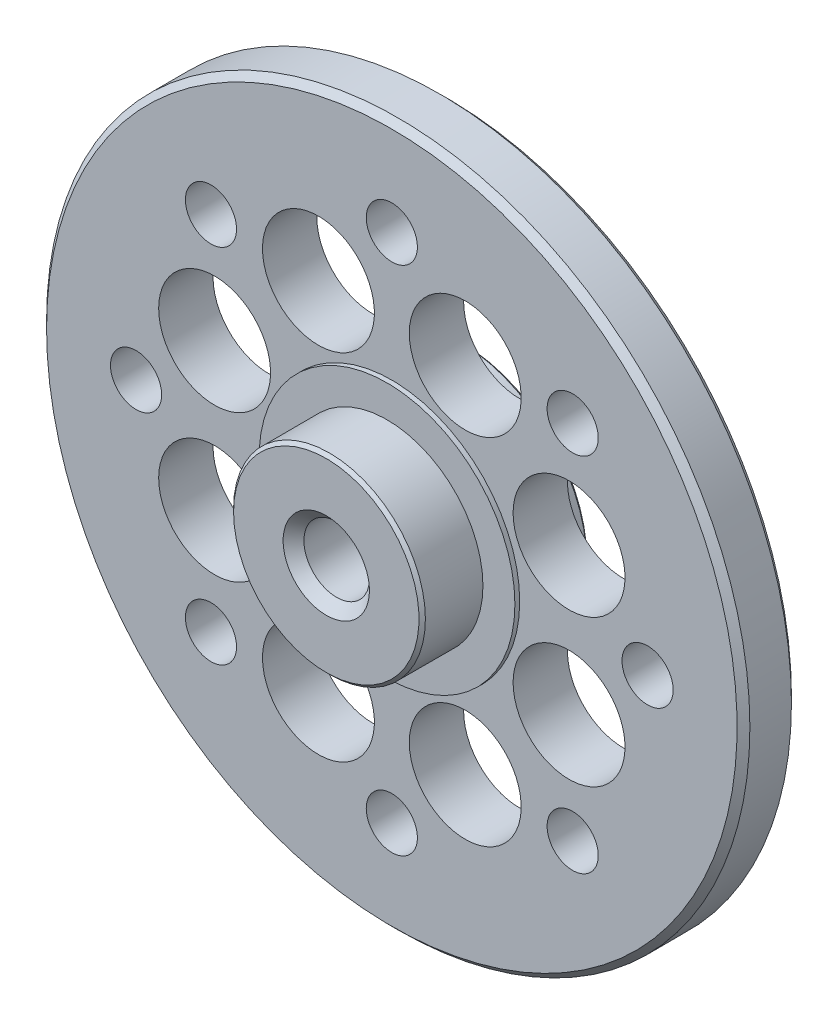
ISO-10303-21;
HEADER;
FILE_DESCRIPTION(('STEP AP214'),'2;1');
FILE_NAME('part.step','',(''),(''),'','','');
FILE_SCHEMA(('AUTOMOTIVE_DESIGN { 1 0 10303 214 1 1 1 1 }'));
ENDSEC;
DATA;
#1=APPLICATION_CONTEXT('core data for automotive mechanical design processes');
#2=APPLICATION_PROTOCOL_DEFINITION('international standard','automotive_design',2000,#1);
#3=PRODUCT_CONTEXT('',#1,'mechanical');
#4=PRODUCT('Part','Part','',(#3));
#5=PRODUCT_RELATED_PRODUCT_CATEGORY('part','',(#4));
#6=PRODUCT_DEFINITION_FORMATION('','',#4);
#7=PRODUCT_DEFINITION_CONTEXT('part definition',#1,'design');
#8=PRODUCT_DEFINITION('design','',#6,#7);
#9=PRODUCT_DEFINITION_SHAPE('','',#8);
#10=(LENGTH_UNIT() NAMED_UNIT(*) SI_UNIT(.MILLI.,.METRE.));
#11=(NAMED_UNIT(*) PLANE_ANGLE_UNIT() SI_UNIT($,.RADIAN.));
#12=(NAMED_UNIT(*) SI_UNIT($,.STERADIAN.) SOLID_ANGLE_UNIT());
#13=UNCERTAINTY_MEASURE_WITH_UNIT(LENGTH_MEASURE(1.E-05),#10,'distance_accuracy_value','');
#14=(GEOMETRIC_REPRESENTATION_CONTEXT(3) GLOBAL_UNCERTAINTY_ASSIGNED_CONTEXT((#13)) GLOBAL_UNIT_ASSIGNED_CONTEXT((#10,
#11,#12)) REPRESENTATION_CONTEXT('',''));
#15=CARTESIAN_POINT('',(0.,0.,0.));
#16=DIRECTION('',(0.,0.,1.));
#17=DIRECTION('',(1.,0.,0.));
#18=AXIS2_PLACEMENT_3D('',#15,#16,#17);
#19=CARTESIAN_POINT('',(0.,0.,3.74999999991132));
#20=DIRECTION('',(0.,0.,1.));
#21=DIRECTION('',(1.,0.,0.));
#22=AXIS2_PLACEMENT_3D('',#19,#20,#21);
#23=CONICAL_SURFACE('',#22,1.35000000000218,0.785398163397448);
#24=CARTESIAN_POINT('',(0.,0.,3.425));
#25=DIRECTION('',(0.,0.,1.));
#26=DIRECTION('',(1.,0.,0.));
#27=AXIS2_PLACEMENT_3D('',#24,#25,#26);
#28=CIRCLE('',#27,1.025);
#29=CARTESIAN_POINT('',(1.025,0.,3.425));
#30=VERTEX_POINT('',#29);
#31=EDGE_CURVE('E30',#30,#30,#28,.F.);
#32=ORIENTED_EDGE('',*,*,#31,.T.);
#33=EDGE_LOOP('',(#32));
#34=FACE_BOUND('',#33,.T.);
#35=CARTESIAN_POINT('',(0.,0.,3.75000000002501));
#36=DIRECTION('',(0.,0.,1.));
#37=DIRECTION('',(1.,0.,0.));
#38=AXIS2_PLACEMENT_3D('',#35,#36,#37);
#39=CIRCLE('',#38,1.35000000011587);
#40=CARTESIAN_POINT('',(1.35000000011587,0.,3.75000000002501));
#41=VERTEX_POINT('',#40);
#42=EDGE_CURVE('E18',#41,#41,#39,.F.);
#43=ORIENTED_EDGE('',*,*,#42,.F.);
#44=EDGE_LOOP('',(#43));
#45=FACE_BOUND('',#44,.T.);
#46=ADVANCED_FACE('F15',(#34,#45),#23,.F.);
#47=CARTESIAN_POINT('',(0.,0.,-1.167));
#48=DIRECTION('',(0.,0.,1.));
#49=DIRECTION('',(1.,0.,0.));
#50=AXIS2_PLACEMENT_3D('',#47,#48,#49);
#51=CYLINDRICAL_SURFACE('',#50,1.025);
#52=ORIENTED_EDGE('',*,*,#31,.F.);
#53=EDGE_LOOP('',(#52));
#54=FACE_BOUND('',#53,.T.);
#55=CARTESIAN_POINT('',(0.,0.,-0.5));
#56=DIRECTION('',(0.,0.,1.));
#57=DIRECTION('',(1.,0.,0.));
#58=AXIS2_PLACEMENT_3D('',#55,#56,#57);
#59=CIRCLE('',#58,1.025);
#60=CARTESIAN_POINT('',(1.025,0.,-0.5));
#61=VERTEX_POINT('',#60);
#62=EDGE_CURVE('E150',#61,#61,#59,.F.);
#63=ORIENTED_EDGE('',*,*,#62,.T.);
#64=EDGE_LOOP('',(#63));
#65=FACE_BOUND('',#64,.T.);
#66=ADVANCED_FACE('F162',(#54,#65),#51,.F.);
#67=CARTESIAN_POINT('',(0.,0.,3.75));
#68=DIRECTION('',(0.,0.,1.));
#69=DIRECTION('',(1.,0.,0.));
#70=AXIS2_PLACEMENT_3D('',#67,#68,#69);
#71=PLANE('',#70);
#72=ORIENTED_EDGE('',*,*,#42,.T.);
#73=EDGE_LOOP('',(#72));
#74=FACE_BOUND('',#73,.T.);
#75=CARTESIAN_POINT('',(0.,0.,3.75000000002501));
#76=DIRECTION('',(0.,0.,-1.));
#77=DIRECTION('',(-1.,0.,0.));
#78=AXIS2_PLACEMENT_3D('',#75,#76,#77);
#79=CIRCLE('',#78,2.900000000011);
#80=CARTESIAN_POINT('',(-2.900000000011,0.,3.75000000002501));
#81=VERTEX_POINT('',#80);
#82=EDGE_CURVE('E148',#81,#81,#79,.T.);
#83=ORIENTED_EDGE('',*,*,#82,.F.);
#84=EDGE_LOOP('',(#83));
#85=FACE_BOUND('',#84,.T.);
#86=ADVANCED_FACE('F164',(#74,#85),#71,.T.);
#87=CARTESIAN_POINT('',(0.,0.,-0.5));
#88=DIRECTION('',(0.,0.,1.));
#89=DIRECTION('',(1.,0.,0.));
#90=AXIS2_PLACEMENT_3D('',#87,#88,#89);
#91=PLANE('',#90);
#92=ORIENTED_EDGE('',*,*,#62,.F.);
#93=EDGE_LOOP('',(#92));
#94=FACE_BOUND('',#93,.T.);
#95=CARTESIAN_POINT('',(0.,0.,-0.499999999988177));
#96=DIRECTION('',(0.,0.,1.));
#97=DIRECTION('',(1.,0.,0.));
#98=AXIS2_PLACEMENT_3D('',#95,#96,#97);
#99=CIRCLE('',#98,3.89999999998736);
#100=CARTESIAN_POINT('',(3.89999999998736,0.,-0.499999999988177));
#101=VERTEX_POINT('',#100);
#102=EDGE_CURVE('E144',#101,#101,#99,.T.);
#103=ORIENTED_EDGE('',*,*,#102,.F.);
#104=EDGE_LOOP('',(#103));
#105=FACE_BOUND('',#104,.T.);
#106=ADVANCED_FACE('F170',(#94,#105),#91,.F.);
#107=CARTESIAN_POINT('',(0.,0.,3.65000000010696));
#108=DIRECTION('',(0.,0.,-1.));
#109=DIRECTION('',(-1.,0.,0.));
#110=AXIS2_PLACEMENT_3D('',#107,#108,#109);
#111=CONICAL_SURFACE('',#110,2.99999999992906,0.785398163397448);
#112=ORIENTED_EDGE('',*,*,#82,.T.);
#113=EDGE_LOOP('',(#112));
#114=FACE_BOUND('',#113,.T.);
#115=CARTESIAN_POINT('',(0.,0.,3.65));
#116=DIRECTION('',(0.,0.,1.));
#117=DIRECTION('',(1.,0.,0.));
#118=AXIS2_PLACEMENT_3D('',#115,#116,#117);
#119=CIRCLE('',#118,3.);
#120=CARTESIAN_POINT('',(3.,0.,3.65));
#121=VERTEX_POINT('',#120);
#122=EDGE_CURVE('E147',#121,#121,#119,.F.);
#123=ORIENTED_EDGE('',*,*,#122,.F.);
#124=EDGE_LOOP('',(#123));
#125=FACE_BOUND('',#124,.T.);
#126=ADVANCED_FACE('F310',(#114,#125),#111,.T.);
#127=CARTESIAN_POINT('',(0.,0.,-0.399999999956435));
#128=DIRECTION('',(0.,0.,1.));
#129=DIRECTION('',(1.,0.,0.));
#130=AXIS2_PLACEMENT_3D('',#127,#128,#129);
#131=CONICAL_SURFACE('',#130,3.99999999996226,0.785398163113231);
#132=CARTESIAN_POINT('',(0.,0.,-0.4));
#133=DIRECTION('',(0.,0.,1.));
#134=DIRECTION('',(1.,0.,0.));
#135=AXIS2_PLACEMENT_3D('',#132,#133,#134);
#136=CIRCLE('',#135,4.);
#137=CARTESIAN_POINT('',(4.,0.,-0.4));
#138=VERTEX_POINT('',#137);
#139=EDGE_CURVE('E562',#138,#138,#136,.T.);
#140=ORIENTED_EDGE('',*,*,#139,.F.);
#141=EDGE_LOOP('',(#140));
#142=FACE_BOUND('',#141,.T.);
#143=ORIENTED_EDGE('',*,*,#102,.T.);
#144=EDGE_LOOP('',(#143));
#145=FACE_BOUND('',#144,.T.);
#146=ADVANCED_FACE('F306',(#142,#145),#131,.T.);
#147=CARTESIAN_POINT('',(0.,0.,-0.7125));
#148=DIRECTION('',(0.,0.,1.));
#149=DIRECTION('',(1.,0.,0.));
#150=AXIS2_PLACEMENT_3D('',#147,#148,#149);
#151=CYLINDRICAL_SURFACE('',#150,3.);
#152=CARTESIAN_POINT('',(0.,0.,1.85));
#153=DIRECTION('',(0.,0.,1.));
#154=DIRECTION('',(1.,0.,0.));
#155=AXIS2_PLACEMENT_3D('',#152,#153,#154);
#156=CIRCLE('',#155,3.);
#157=CARTESIAN_POINT('',(3.,0.,1.85));
#158=VERTEX_POINT('',#157);
#159=EDGE_CURVE('E140',#158,#158,#156,.F.);
#160=ORIENTED_EDGE('',*,*,#159,.F.);
#161=EDGE_LOOP('',(#160));
#162=FACE_BOUND('',#161,.T.);
#163=ORIENTED_EDGE('',*,*,#122,.T.);
#164=EDGE_LOOP('',(#163));
#165=FACE_BOUND('',#164,.T.);
#166=ADVANCED_FACE('F302',(#162,#165),#151,.T.);
#167=CARTESIAN_POINT('',(0.,0.,0.200001241523865));
#168=DIRECTION('',(0.,0.,1.));
#169=DIRECTION('',(1.,0.,0.));
#170=AXIS2_PLACEMENT_3D('',#167,#168,#169);
#171=CONICAL_SURFACE('',#170,10.9999997023146,0.785398093433157);
#172=CARTESIAN_POINT('',(0.,0.,0.2000009438385));
#173=DIRECTION('',(0.,0.,1.));
#174=DIRECTION('',(1.,0.,0.));
#175=AXIS2_PLACEMENT_3D('',#172,#173,#174);
#176=CIRCLE('',#175,11.);
#177=CARTESIAN_POINT('',(11.,0.,0.2000009438385));
#178=VERTEX_POINT('',#177);
#179=EDGE_CURVE('E143',#178,#178,#176,.T.);
#180=ORIENTED_EDGE('',*,*,#179,.F.);
#181=EDGE_LOOP('',(#180));
#182=FACE_BOUND('',#181,.T.);
#183=CARTESIAN_POINT('',(0.,0.,2.93602862508346E-07));
#184=DIRECTION('',(0.,0.,1.));
#185=DIRECTION('',(1.,0.,0.));
#186=AXIS2_PLACEMENT_3D('',#183,#184,#185);
#187=CIRCLE('',#186,10.7999987823794);
#188=CARTESIAN_POINT('',(10.7999987823794,0.,2.93602862508346E-07));
#189=VERTEX_POINT('',#188);
#190=EDGE_CURVE('E137',#189,#189,#187,.T.);
#191=ORIENTED_EDGE('',*,*,#190,.T.);
#192=EDGE_LOOP('',(#191));
#193=FACE_BOUND('',#192,.T.);
#194=ADVANCED_FACE('F298',(#182,#193),#171,.T.);
#195=CARTESIAN_POINT('',(0.,0.,-0.7125));
#196=DIRECTION('',(0.,0.,1.));
#197=DIRECTION('',(1.,0.,0.));
#198=AXIS2_PLACEMENT_3D('',#195,#196,#197);
#199=CYLINDRICAL_SURFACE('',#198,4.);
#200=ORIENTED_EDGE('',*,*,#139,.T.);
#201=EDGE_LOOP('',(#200));
#202=FACE_BOUND('',#201,.T.);
#203=CARTESIAN_POINT('',(0.,0.,0.));
#204=DIRECTION('',(0.,0.,1.));
#205=DIRECTION('',(1.,0.,0.));
#206=AXIS2_PLACEMENT_3D('',#203,#204,#205);
#207=CIRCLE('',#206,4.);
#208=CARTESIAN_POINT('',(4.,0.,0.));
#209=VERTEX_POINT('',#208);
#210=EDGE_CURVE('E134',#209,#209,#207,.F.);
#211=ORIENTED_EDGE('',*,*,#210,.T.);
#212=EDGE_LOOP('',(#211));
#213=FACE_BOUND('',#212,.T.);
#214=ADVANCED_FACE('F294',(#202,#213),#199,.T.);
#215=CARTESIAN_POINT('',(0.,0.,-0.7125));
#216=DIRECTION('',(0.,0.,1.));
#217=DIRECTION('',(1.,0.,0.));
#218=AXIS2_PLACEMENT_3D('',#215,#216,#217);
#219=CYLINDRICAL_SURFACE('',#218,11.);
#220=ORIENTED_EDGE('',*,*,#179,.T.);
#221=EDGE_LOOP('',(#220));
#222=FACE_BOUND('',#221,.T.);
#223=CARTESIAN_POINT('',(-1.143529715364E-13,-1.914050469143E-13,1.49999895098278));
#224=DIRECTION('',(0.,0.,-1.));
#225=DIRECTION('',(0.,-1.,0.));
#226=AXIS2_PLACEMENT_3D('',#223,#224,#225);
#227=CIRCLE('',#226,10.9999997203079);
#228=CARTESIAN_POINT('',(-1.143529715364E-13,-10.9999997203081,1.49999895098278));
#229=VERTEX_POINT('',#228);
#230=EDGE_CURVE('E109',#229,#229,#227,.F.);
#231=ORIENTED_EDGE('',*,*,#230,.F.);
#232=EDGE_LOOP('',(#231));
#233=FACE_BOUND('',#232,.T.);
#234=ADVANCED_FACE('F290',(#222,#233),#219,.T.);
#235=CARTESIAN_POINT('',(0.,0.,1.85));
#236=DIRECTION('',(0.,0.,1.));
#237=DIRECTION('',(1.,0.,0.));
#238=AXIS2_PLACEMENT_3D('',#235,#236,#237);
#239=PLANE('',#238);
#240=ORIENTED_EDGE('',*,*,#159,.T.);
#241=EDGE_LOOP('',(#240));
#242=FACE_BOUND('',#241,.T.);
#243=CARTESIAN_POINT('',(0.,0.,1.85));
#244=DIRECTION('',(0.,0.,1.));
#245=DIRECTION('',(1.,0.,0.));
#246=AXIS2_PLACEMENT_3D('',#243,#244,#245);
#247=CIRCLE('',#246,4.);
#248=CARTESIAN_POINT('',(4.,0.,1.85));
#249=VERTEX_POINT('',#248);
#250=EDGE_CURVE('E105',#249,#249,#247,.F.);
#251=ORIENTED_EDGE('',*,*,#250,.F.);
#252=EDGE_LOOP('',(#251));
#253=FACE_BOUND('',#252,.T.);
#254=ADVANCED_FACE('F286',(#242,#253),#239,.T.);
#255=CARTESIAN_POINT('',(5.656854249492,5.656854249492,5.6843418860808E-11));
#256=DIRECTION('',(0.,0.,-1.));
#257=DIRECTION('',(-1.,0.,0.));
#258=AXIS2_PLACEMENT_3D('',#255,#256,#257);
#259=CONICAL_SURFACE('',#258,1.04999999989511,0.785398163283761);
#260=CARTESIAN_POINT('',(5.656854249492,5.656854249492,0.25));
#261=DIRECTION('',(0.,0.,-1.));
#262=DIRECTION('',(-1.,0.,0.));
#263=AXIS2_PLACEMENT_3D('',#260,#261,#262);
#264=CIRCLE('',#263,0.8);
#265=CARTESIAN_POINT('',(4.856854249492,5.656854249492,0.25));
#266=VERTEX_POINT('',#265);
#267=EDGE_CURVE('E108',#266,#266,#264,.F.);
#268=ORIENTED_EDGE('',*,*,#267,.T.);
#269=EDGE_LOOP('',(#268));
#270=FACE_BOUND('',#269,.T.);
#271=CARTESIAN_POINT('',(5.656854249492,5.656854249492,0.));
#272=DIRECTION('',(0.,0.,-1.));
#273=DIRECTION('',(-1.,0.,0.));
#274=AXIS2_PLACEMENT_3D('',#271,#272,#273);
#275=CIRCLE('',#274,1.04999999995195);
#276=CARTESIAN_POINT('',(4.60685424954005,5.656854249492,0.));
#277=VERTEX_POINT('',#276);
#278=EDGE_CURVE('E131',#277,#277,#275,.T.);
#279=ORIENTED_EDGE('',*,*,#278,.T.);
#280=EDGE_LOOP('',(#279));
#281=FACE_BOUND('',#280,.T.);
#282=ADVANCED_FACE('F282',(#270,#281),#259,.F.);
#283=CARTESIAN_POINT('',(8.,0.,1.13686837721616E-10));
#284=DIRECTION('',(0.,0.,-1.));
#285=DIRECTION('',(-1.,0.,0.));
#286=AXIS2_PLACEMENT_3D('',#283,#284,#285);
#287=CONICAL_SURFACE('',#286,1.04999999988831,0.785398163397448);
#288=CARTESIAN_POINT('',(8.,0.,0.25));
#289=DIRECTION('',(0.,0.,-1.));
#290=DIRECTION('',(-1.,0.,0.));
#291=AXIS2_PLACEMENT_3D('',#288,#289,#290);
#292=CIRCLE('',#291,0.8);
#293=CARTESIAN_POINT('',(7.2,0.,0.25));
#294=VERTEX_POINT('',#293);
#295=EDGE_CURVE('E572',#294,#294,#292,.F.);
#296=ORIENTED_EDGE('',*,*,#295,.T.);
#297=EDGE_LOOP('',(#296));
#298=FACE_BOUND('',#297,.T.);
#299=CARTESIAN_POINT('',(8.,0.,0.));
#300=DIRECTION('',(0.,0.,-1.));
#301=DIRECTION('',(-1.,0.,0.));
#302=AXIS2_PLACEMENT_3D('',#299,#300,#301);
#303=CIRCLE('',#302,1.050000000002);
#304=CARTESIAN_POINT('',(6.949999999998,0.,0.));
#305=VERTEX_POINT('',#304);
#306=EDGE_CURVE('E128',#305,#305,#303,.T.);
#307=ORIENTED_EDGE('',*,*,#306,.T.);
#308=EDGE_LOOP('',(#307));
#309=FACE_BOUND('',#308,.T.);
#310=ADVANCED_FACE('F278',(#298,#309),#287,.F.);
#311=CARTESIAN_POINT('',(5.656854249492,-5.656854249492,5.6843418860808E-11));
#312=DIRECTION('',(0.,0.,-1.));
#313=DIRECTION('',(-1.,0.,0.));
#314=AXIS2_PLACEMENT_3D('',#311,#312,#313);
#315=CONICAL_SURFACE('',#314,1.04999999989511,0.785398163283761);
#316=CARTESIAN_POINT('',(5.656854249492,-5.656854249492,0.25));
#317=DIRECTION('',(0.,0.,-1.));
#318=DIRECTION('',(-1.,0.,0.));
#319=AXIS2_PLACEMENT_3D('',#316,#317,#318);
#320=CIRCLE('',#319,0.8);
#321=CARTESIAN_POINT('',(4.856854249492,-5.656854249492,0.25));
#322=VERTEX_POINT('',#321);
#323=EDGE_CURVE('E575',#322,#322,#320,.F.);
#324=ORIENTED_EDGE('',*,*,#323,.T.);
#325=EDGE_LOOP('',(#324));
#326=FACE_BOUND('',#325,.T.);
#327=CARTESIAN_POINT('',(5.656854249492,-5.656854249492,0.));
#328=DIRECTION('',(0.,0.,-1.));
#329=DIRECTION('',(-1.,0.,0.));
#330=AXIS2_PLACEMENT_3D('',#327,#328,#329);
#331=CIRCLE('',#330,1.04999999995195);
#332=CARTESIAN_POINT('',(4.60685424954005,-5.656854249492,0.));
#333=VERTEX_POINT('',#332);
#334=EDGE_CURVE('E125',#333,#333,#331,.T.);
#335=ORIENTED_EDGE('',*,*,#334,.T.);
#336=EDGE_LOOP('',(#335));
#337=FACE_BOUND('',#336,.T.);
#338=ADVANCED_FACE('F274',(#326,#337),#315,.F.);
#339=CARTESIAN_POINT('',(0.,-8.,1.70530256582424E-10));
#340=DIRECTION('',(0.,0.,-1.));
#341=DIRECTION('',(-1.,0.,0.));
#342=AXIS2_PLACEMENT_3D('',#339,#340,#341);
#343=CONICAL_SURFACE('',#342,1.04999999979327,0.785398163397448);
#344=CARTESIAN_POINT('',(0.,-8.,0.25));
#345=DIRECTION('',(0.,0.,-1.));
#346=DIRECTION('',(-1.,0.,0.));
#347=AXIS2_PLACEMENT_3D('',#344,#345,#346);
#348=CIRCLE('',#347,0.8);
#349=CARTESIAN_POINT('',(-0.8,-8.,0.25));
#350=VERTEX_POINT('',#349);
#351=EDGE_CURVE('E578',#350,#350,#348,.F.);
#352=ORIENTED_EDGE('',*,*,#351,.T.);
#353=EDGE_LOOP('',(#352));
#354=FACE_BOUND('',#353,.T.);
#355=CARTESIAN_POINT('',(0.,-8.,5.6843418860808E-11));
#356=DIRECTION('',(0.,0.,-1.));
#357=DIRECTION('',(-1.,0.,0.));
#358=AXIS2_PLACEMENT_3D('',#355,#356,#357);
#359=CIRCLE('',#358,1.04999999990696);
#360=CARTESIAN_POINT('',(-1.04999999990696,-8.,5.6843418860808E-11));
#361=VERTEX_POINT('',#360);
#362=EDGE_CURVE('E122',#361,#361,#359,.T.);
#363=ORIENTED_EDGE('',*,*,#362,.T.);
#364=EDGE_LOOP('',(#363));
#365=FACE_BOUND('',#364,.T.);
#366=ADVANCED_FACE('F270',(#354,#365),#343,.F.);
#367=CARTESIAN_POINT('',(-5.656854249492,-5.656854249492,5.6843418860808E-11));
#368=DIRECTION('',(0.,0.,-1.));
#369=DIRECTION('',(-1.,0.,0.));
#370=AXIS2_PLACEMENT_3D('',#367,#368,#369);
#371=CONICAL_SURFACE('',#370,1.04999999991881,0.785398163397448);
#372=CARTESIAN_POINT('',(-5.656854249492,-5.656854249492,0.25));
#373=DIRECTION('',(0.,0.,-1.));
#374=DIRECTION('',(-1.,0.,0.));
#375=AXIS2_PLACEMENT_3D('',#372,#373,#374);
#376=CIRCLE('',#375,0.8);
#377=CARTESIAN_POINT('',(-6.456854249492,-5.656854249492,0.25));
#378=VERTEX_POINT('',#377);
#379=EDGE_CURVE('E581',#378,#378,#376,.F.);
#380=ORIENTED_EDGE('',*,*,#379,.T.);
#381=EDGE_LOOP('',(#380));
#382=FACE_BOUND('',#381,.T.);
#383=CARTESIAN_POINT('',(-5.656854249492,-5.656854249492,0.));
#384=DIRECTION('',(0.,0.,-1.));
#385=DIRECTION('',(-1.,0.,0.));
#386=AXIS2_PLACEMENT_3D('',#383,#384,#385);
#387=CIRCLE('',#386,1.04999999997565);
#388=CARTESIAN_POINT('',(-6.70685424946765,-5.656854249492,0.));
#389=VERTEX_POINT('',#388);
#390=EDGE_CURVE('E119',#389,#389,#387,.T.);
#391=ORIENTED_EDGE('',*,*,#390,.T.);
#392=EDGE_LOOP('',(#391));
#393=FACE_BOUND('',#392,.T.);
#394=ADVANCED_FACE('F266',(#382,#393),#371,.F.);
#395=CARTESIAN_POINT('',(-8.,0.,5.6843418860808E-11));
#396=DIRECTION('',(0.,0.,-1.));
#397=DIRECTION('',(-1.,0.,0.));
#398=AXIS2_PLACEMENT_3D('',#395,#396,#397);
#399=CONICAL_SURFACE('',#398,1.04999999998245,0.785398163397448);
#400=CARTESIAN_POINT('',(-8.,0.,0.25));
#401=DIRECTION('',(0.,0.,-1.));
#402=DIRECTION('',(-1.,0.,0.));
#403=AXIS2_PLACEMENT_3D('',#400,#401,#402);
#404=CIRCLE('',#403,0.8);
#405=CARTESIAN_POINT('',(-8.8,0.,0.25));
#406=VERTEX_POINT('',#405);
#407=EDGE_CURVE('E584',#406,#406,#404,.F.);
#408=ORIENTED_EDGE('',*,*,#407,.T.);
#409=EDGE_LOOP('',(#408));
#410=FACE_BOUND('',#409,.T.);
#411=CARTESIAN_POINT('',(-8.,0.,0.));
#412=DIRECTION('',(0.,0.,-1.));
#413=DIRECTION('',(-1.,0.,0.));
#414=AXIS2_PLACEMENT_3D('',#411,#412,#413);
#415=CIRCLE('',#414,1.05000000003929);
#416=CARTESIAN_POINT('',(-9.05000000003929,0.,0.));
#417=VERTEX_POINT('',#416);
#418=EDGE_CURVE('E116',#417,#417,#415,.T.);
#419=ORIENTED_EDGE('',*,*,#418,.T.);
#420=EDGE_LOOP('',(#419));
#421=FACE_BOUND('',#420,.T.);
#422=ADVANCED_FACE('F262',(#410,#421),#399,.F.);
#423=CARTESIAN_POINT('',(-5.656854249492,5.656854249492,5.6843418860808E-11));
#424=DIRECTION('',(0.,0.,-1.));
#425=DIRECTION('',(-1.,0.,0.));
#426=AXIS2_PLACEMENT_3D('',#423,#424,#425);
#427=CONICAL_SURFACE('',#426,1.04999999991881,0.785398163397448);
#428=CARTESIAN_POINT('',(-5.656854249492,5.656854249492,0.25));
#429=DIRECTION('',(0.,0.,-1.));
#430=DIRECTION('',(-1.,0.,0.));
#431=AXIS2_PLACEMENT_3D('',#428,#429,#430);
#432=CIRCLE('',#431,0.8);
#433=CARTESIAN_POINT('',(-6.456854249492,5.656854249492,0.25));
#434=VERTEX_POINT('',#433);
#435=EDGE_CURVE('E587',#434,#434,#432,.F.);
#436=ORIENTED_EDGE('',*,*,#435,.T.);
#437=EDGE_LOOP('',(#436));
#438=FACE_BOUND('',#437,.T.);
#439=CARTESIAN_POINT('',(-5.656854249492,5.656854249492,0.));
#440=DIRECTION('',(0.,0.,-1.));
#441=DIRECTION('',(-1.,0.,0.));
#442=AXIS2_PLACEMENT_3D('',#439,#440,#441);
#443=CIRCLE('',#442,1.04999999997565);
#444=CARTESIAN_POINT('',(-6.70685424946765,5.656854249492,0.));
#445=VERTEX_POINT('',#444);
#446=EDGE_CURVE('E113',#445,#445,#443,.T.);
#447=ORIENTED_EDGE('',*,*,#446,.T.);
#448=EDGE_LOOP('',(#447));
#449=FACE_BOUND('',#448,.T.);
#450=ADVANCED_FACE('F258',(#438,#449),#427,.F.);
#451=CARTESIAN_POINT('',(0.,8.,1.70530256582424E-10));
#452=DIRECTION('',(0.,0.,-1.));
#453=DIRECTION('',(-1.,0.,0.));
#454=AXIS2_PLACEMENT_3D('',#451,#452,#453);
#455=CONICAL_SURFACE('',#454,1.04999999979327,0.785398163397448);
#456=CARTESIAN_POINT('',(0.,8.,0.25));
#457=DIRECTION('',(0.,0.,-1.));
#458=DIRECTION('',(-1.,0.,0.));
#459=AXIS2_PLACEMENT_3D('',#456,#457,#458);
#460=CIRCLE('',#459,0.8);
#461=CARTESIAN_POINT('',(-0.8,8.,0.25));
#462=VERTEX_POINT('',#461);
#463=EDGE_CURVE('E104',#462,#462,#460,.F.);
#464=ORIENTED_EDGE('',*,*,#463,.T.);
#465=EDGE_LOOP('',(#464));
#466=FACE_BOUND('',#465,.T.);
#467=CARTESIAN_POINT('',(0.,8.,5.6843418860808E-11));
#468=DIRECTION('',(0.,0.,-1.));
#469=DIRECTION('',(-1.,0.,0.));
#470=AXIS2_PLACEMENT_3D('',#467,#468,#469);
#471=CIRCLE('',#470,1.04999999990696);
#472=CARTESIAN_POINT('',(-1.04999999990696,8.,5.6843418860808E-11));
#473=VERTEX_POINT('',#472);
#474=EDGE_CURVE('E110',#473,#473,#471,.T.);
#475=ORIENTED_EDGE('',*,*,#474,.T.);
#476=EDGE_LOOP('',(#475));
#477=FACE_BOUND('',#476,.T.);
#478=ADVANCED_FACE('F254',(#466,#477),#455,.F.);
#479=CARTESIAN_POINT('',(0.,0.,0.));
#480=DIRECTION('',(0.,0.,1.));
#481=DIRECTION('',(1.,0.,0.));
#482=AXIS2_PLACEMENT_3D('',#479,#480,#481);
#483=PLANE('',#482);
#484=CARTESIAN_POINT('',(-2.296100594191,5.543277195068,0.));
#485=DIRECTION('',(0.,0.,-1.));
#486=DIRECTION('',(-1.,0.,0.));
#487=AXIS2_PLACEMENT_3D('',#484,#485,#486);
#488=CIRCLE('',#487,1.75);
#489=CARTESIAN_POINT('',(-4.046100594191,5.543277195068,0.));
#490=VERTEX_POINT('',#489);
#491=EDGE_CURVE('E80',#490,#490,#488,.F.);
#492=ORIENTED_EDGE('',*,*,#491,.T.);
#493=EDGE_LOOP('',(#492));
#494=FACE_BOUND('',#493,.T.);
#495=CARTESIAN_POINT('',(-5.543277195068,2.296100594191,0.));
#496=DIRECTION('',(0.,0.,-1.));
#497=DIRECTION('',(-1.,0.,0.));
#498=AXIS2_PLACEMENT_3D('',#495,#496,#497);
#499=CIRCLE('',#498,1.75);
#500=CARTESIAN_POINT('',(-7.293277195068,2.296100594191,0.));
#501=VERTEX_POINT('',#500);
#502=EDGE_CURVE('E83',#501,#501,#499,.F.);
#503=ORIENTED_EDGE('',*,*,#502,.T.);
#504=EDGE_LOOP('',(#503));
#505=FACE_BOUND('',#504,.T.);
#506=CARTESIAN_POINT('',(-5.543277195068,-2.296100594191,0.));
#507=DIRECTION('',(0.,0.,-1.));
#508=DIRECTION('',(-1.,0.,0.));
#509=AXIS2_PLACEMENT_3D('',#506,#507,#508);
#510=CIRCLE('',#509,1.75);
#511=CARTESIAN_POINT('',(-7.293277195068,-2.296100594191,0.));
#512=VERTEX_POINT('',#511);
#513=EDGE_CURVE('E86',#512,#512,#510,.F.);
#514=ORIENTED_EDGE('',*,*,#513,.T.);
#515=EDGE_LOOP('',(#514));
#516=FACE_BOUND('',#515,.T.);
#517=CARTESIAN_POINT('',(-2.296100594191,-5.543277195068,0.));
#518=DIRECTION('',(0.,0.,-1.));
#519=DIRECTION('',(-1.,0.,0.));
#520=AXIS2_PLACEMENT_3D('',#517,#518,#519);
#521=CIRCLE('',#520,1.75);
#522=CARTESIAN_POINT('',(-4.046100594191,-5.543277195068,0.));
#523=VERTEX_POINT('',#522);
#524=EDGE_CURVE('E89',#523,#523,#521,.F.);
#525=ORIENTED_EDGE('',*,*,#524,.T.);
#526=EDGE_LOOP('',(#525));
#527=FACE_BOUND('',#526,.T.);
#528=CARTESIAN_POINT('',(2.296100594191,-5.543277195068,0.));
#529=DIRECTION('',(0.,0.,-1.));
#530=DIRECTION('',(-1.,0.,0.));
#531=AXIS2_PLACEMENT_3D('',#528,#529,#530);
#532=CIRCLE('',#531,1.75);
#533=CARTESIAN_POINT('',(0.546100594191,-5.543277195068,0.));
#534=VERTEX_POINT('',#533);
#535=EDGE_CURVE('E92',#534,#534,#532,.F.);
#536=ORIENTED_EDGE('',*,*,#535,.T.);
#537=EDGE_LOOP('',(#536));
#538=FACE_BOUND('',#537,.T.);
#539=CARTESIAN_POINT('',(5.543277195068,-2.296100594191,0.));
#540=DIRECTION('',(0.,0.,-1.));
#541=DIRECTION('',(-1.,0.,0.));
#542=AXIS2_PLACEMENT_3D('',#539,#540,#541);
#543=CIRCLE('',#542,1.75);
#544=CARTESIAN_POINT('',(3.793277195068,-2.296100594191,0.));
#545=VERTEX_POINT('',#544);
#546=EDGE_CURVE('E95',#545,#545,#543,.F.);
#547=ORIENTED_EDGE('',*,*,#546,.T.);
#548=EDGE_LOOP('',(#547));
#549=FACE_BOUND('',#548,.T.);
#550=CARTESIAN_POINT('',(5.543277195068,2.296100594191,0.));
#551=DIRECTION('',(0.,0.,-1.));
#552=DIRECTION('',(-1.,0.,0.));
#553=AXIS2_PLACEMENT_3D('',#550,#551,#552);
#554=CIRCLE('',#553,1.75);
#555=CARTESIAN_POINT('',(3.793277195068,2.296100594191,0.));
#556=VERTEX_POINT('',#555);
#557=EDGE_CURVE('E98',#556,#556,#554,.F.);
#558=ORIENTED_EDGE('',*,*,#557,.T.);
#559=EDGE_LOOP('',(#558));
#560=FACE_BOUND('',#559,.T.);
#561=CARTESIAN_POINT('',(2.296100594191,5.543277195068,0.));
#562=DIRECTION('',(0.,0.,-1.));
#563=DIRECTION('',(-1.,0.,0.));
#564=AXIS2_PLACEMENT_3D('',#561,#562,#563);
#565=CIRCLE('',#564,1.75);
#566=CARTESIAN_POINT('',(0.546100594191,5.543277195068,0.));
#567=VERTEX_POINT('',#566);
#568=EDGE_CURVE('E101',#567,#567,#565,.F.);
#569=ORIENTED_EDGE('',*,*,#568,.T.);
#570=EDGE_LOOP('',(#569));
#571=FACE_BOUND('',#570,.T.);
#572=ORIENTED_EDGE('',*,*,#474,.F.);
#573=EDGE_LOOP('',(#572));
#574=FACE_BOUND('',#573,.T.);
#575=ORIENTED_EDGE('',*,*,#446,.F.);
#576=EDGE_LOOP('',(#575));
#577=FACE_BOUND('',#576,.T.);
#578=ORIENTED_EDGE('',*,*,#418,.F.);
#579=EDGE_LOOP('',(#578));
#580=FACE_BOUND('',#579,.T.);
#581=ORIENTED_EDGE('',*,*,#390,.F.);
#582=EDGE_LOOP('',(#581));
#583=FACE_BOUND('',#582,.T.);
#584=ORIENTED_EDGE('',*,*,#362,.F.);
#585=EDGE_LOOP('',(#584));
#586=FACE_BOUND('',#585,.T.);
#587=ORIENTED_EDGE('',*,*,#334,.F.);
#588=EDGE_LOOP('',(#587));
#589=FACE_BOUND('',#588,.T.);
#590=ORIENTED_EDGE('',*,*,#306,.F.);
#591=EDGE_LOOP('',(#590));
#592=FACE_BOUND('',#591,.T.);
#593=ORIENTED_EDGE('',*,*,#278,.F.);
#594=EDGE_LOOP('',(#593));
#595=FACE_BOUND('',#594,.T.);
#596=ORIENTED_EDGE('',*,*,#210,.F.);
#597=EDGE_LOOP('',(#596));
#598=FACE_BOUND('',#597,.T.);
#599=ORIENTED_EDGE('',*,*,#190,.F.);
#600=EDGE_LOOP('',(#599));
#601=FACE_BOUND('',#600,.T.);
#602=ADVANCED_FACE('F250',(#494,#505,#516,#527,#538,#549,#560,#571,#574,#577,#580,#583,#586,
#589,#592,#595,#598,#601),#483,.F.);
#603=CARTESIAN_POINT('',(-1.143529715364E-13,-1.91686944095437E-13,1.49999895098278));
#604=DIRECTION('',(0.,0.,-1.));
#605=DIRECTION('',(-1.,0.,0.));
#606=AXIS2_PLACEMENT_3D('',#603,#604,#605);
#607=CONICAL_SURFACE('',#606,10.9999997203079,0.785398103001233);
#608=CARTESIAN_POINT('',(0.,0.,1.69999972429918));
#609=DIRECTION('',(0.,0.,-1.));
#610=DIRECTION('',(-1.,0.,0.));
#611=AXIS2_PLACEMENT_3D('',#608,#609,#610);
#612=CIRCLE('',#611,10.7999989711501);
#613=CARTESIAN_POINT('',(-10.7999989711501,0.,1.69999972429918));
#614=VERTEX_POINT('',#613);
#615=EDGE_CURVE('E77',#614,#614,#612,.F.);
#616=ORIENTED_EDGE('',*,*,#615,.F.);
#617=EDGE_LOOP('',(#616));
#618=FACE_BOUND('',#617,.T.);
#619=ORIENTED_EDGE('',*,*,#230,.T.);
#620=EDGE_LOOP('',(#619));
#621=FACE_BOUND('',#620,.T.);
#622=ADVANCED_FACE('F246',(#618,#621),#607,.T.);
#623=CARTESIAN_POINT('',(0.,0.,-0.7125));
#624=DIRECTION('',(0.,0.,1.));
#625=DIRECTION('',(1.,0.,0.));
#626=AXIS2_PLACEMENT_3D('',#623,#624,#625);
#627=CYLINDRICAL_SURFACE('',#626,4.);
#628=CARTESIAN_POINT('',(0.,0.,1.7));
#629=DIRECTION('',(0.,0.,1.));
#630=DIRECTION('',(1.,0.,0.));
#631=AXIS2_PLACEMENT_3D('',#628,#629,#630);
#632=CIRCLE('',#631,4.);
#633=CARTESIAN_POINT('',(4.,0.,1.7));
#634=VERTEX_POINT('',#633);
#635=EDGE_CURVE('E74',#634,#634,#632,.F.);
#636=ORIENTED_EDGE('',*,*,#635,.F.);
#637=EDGE_LOOP('',(#636));
#638=FACE_BOUND('',#637,.T.);
#639=ORIENTED_EDGE('',*,*,#250,.T.);
#640=EDGE_LOOP('',(#639));
#641=FACE_BOUND('',#640,.T.);
#642=ADVANCED_FACE('F242',(#638,#641),#627,.T.);
#643=CARTESIAN_POINT('',(5.656854249492,5.656854249492,4.392));
#644=DIRECTION('',(0.,0.,-1.));
#645=DIRECTION('',(-1.,0.,0.));
#646=AXIS2_PLACEMENT_3D('',#643,#644,#645);
#647=CYLINDRICAL_SURFACE('',#646,0.8);
#648=ORIENTED_EDGE('',*,*,#267,.F.);
#649=EDGE_LOOP('',(#648));
#650=FACE_BOUND('',#649,.T.);
#651=CARTESIAN_POINT('',(5.656854249492,5.656854249492,1.7));
#652=DIRECTION('',(0.,0.,-1.));
#653=DIRECTION('',(-1.,0.,0.));
#654=AXIS2_PLACEMENT_3D('',#651,#652,#653);
#655=CIRCLE('',#654,0.8);
#656=CARTESIAN_POINT('',(4.856854249492,5.656854249492,1.7));
#657=VERTEX_POINT('',#656);
#658=EDGE_CURVE('E71',#657,#657,#655,.T.);
#659=ORIENTED_EDGE('',*,*,#658,.F.);
#660=EDGE_LOOP('',(#659));
#661=FACE_BOUND('',#660,.T.);
#662=ADVANCED_FACE('F238',(#650,#661),#647,.F.);
#663=CARTESIAN_POINT('',(8.,0.,4.38375));
#664=DIRECTION('',(0.,0.,-1.));
#665=DIRECTION('',(-1.,0.,0.));
#666=AXIS2_PLACEMENT_3D('',#663,#664,#665);
#667=CYLINDRICAL_SURFACE('',#666,0.8);
#668=ORIENTED_EDGE('',*,*,#295,.F.);
#669=EDGE_LOOP('',(#668));
#670=FACE_BOUND('',#669,.T.);
#671=CARTESIAN_POINT('',(8.,0.,1.7));
#672=DIRECTION('',(0.,0.,-1.));
#673=DIRECTION('',(-1.,0.,0.));
#674=AXIS2_PLACEMENT_3D('',#671,#672,#673);
#675=CIRCLE('',#674,0.8);
#676=CARTESIAN_POINT('',(7.2,0.,1.7));
#677=VERTEX_POINT('',#676);
#678=EDGE_CURVE('E68',#677,#677,#675,.T.);
#679=ORIENTED_EDGE('',*,*,#678,.F.);
#680=EDGE_LOOP('',(#679));
#681=FACE_BOUND('',#680,.T.);
#682=ADVANCED_FACE('F234',(#670,#681),#667,.F.);
#683=CARTESIAN_POINT('',(5.656854249492,-5.656854249492,4.38375));
#684=DIRECTION('',(0.,0.,-1.));
#685=DIRECTION('',(-1.,0.,0.));
#686=AXIS2_PLACEMENT_3D('',#683,#684,#685);
#687=CYLINDRICAL_SURFACE('',#686,0.8);
#688=ORIENTED_EDGE('',*,*,#323,.F.);
#689=EDGE_LOOP('',(#688));
#690=FACE_BOUND('',#689,.T.);
#691=CARTESIAN_POINT('',(5.656854249492,-5.656854249492,1.7));
#692=DIRECTION('',(0.,0.,-1.));
#693=DIRECTION('',(-1.,0.,0.));
#694=AXIS2_PLACEMENT_3D('',#691,#692,#693);
#695=CIRCLE('',#694,0.8);
#696=CARTESIAN_POINT('',(4.856854249492,-5.656854249492,1.7));
#697=VERTEX_POINT('',#696);
#698=EDGE_CURVE('E65',#697,#697,#695,.T.);
#699=ORIENTED_EDGE('',*,*,#698,.F.);
#700=EDGE_LOOP('',(#699));
#701=FACE_BOUND('',#700,.T.);
#702=ADVANCED_FACE('F230',(#690,#701),#687,.F.);
#703=CARTESIAN_POINT('',(0.,-8.,4.38375));
#704=DIRECTION('',(0.,0.,-1.));
#705=DIRECTION('',(-1.,0.,0.));
#706=AXIS2_PLACEMENT_3D('',#703,#704,#705);
#707=CYLINDRICAL_SURFACE('',#706,0.8);
#708=ORIENTED_EDGE('',*,*,#351,.F.);
#709=EDGE_LOOP('',(#708));
#710=FACE_BOUND('',#709,.T.);
#711=CARTESIAN_POINT('',(0.,-8.,1.7));
#712=DIRECTION('',(0.,0.,-1.));
#713=DIRECTION('',(-1.,0.,0.));
#714=AXIS2_PLACEMENT_3D('',#711,#712,#713);
#715=CIRCLE('',#714,0.8);
#716=CARTESIAN_POINT('',(-0.8,-8.,1.7));
#717=VERTEX_POINT('',#716);
#718=EDGE_CURVE('E62',#717,#717,#715,.T.);
#719=ORIENTED_EDGE('',*,*,#718,.F.);
#720=EDGE_LOOP('',(#719));
#721=FACE_BOUND('',#720,.T.);
#722=ADVANCED_FACE('F226',(#710,#721),#707,.F.);
#723=CARTESIAN_POINT('',(-5.656854249492,-5.656854249492,4.38375));
#724=DIRECTION('',(0.,0.,-1.));
#725=DIRECTION('',(-1.,0.,0.));
#726=AXIS2_PLACEMENT_3D('',#723,#724,#725);
#727=CYLINDRICAL_SURFACE('',#726,0.8);
#728=ORIENTED_EDGE('',*,*,#379,.F.);
#729=EDGE_LOOP('',(#728));
#730=FACE_BOUND('',#729,.T.);
#731=CARTESIAN_POINT('',(-5.656854249492,-5.656854249492,1.7));
#732=DIRECTION('',(0.,0.,-1.));
#733=DIRECTION('',(-1.,0.,0.));
#734=AXIS2_PLACEMENT_3D('',#731,#732,#733);
#735=CIRCLE('',#734,0.8);
#736=CARTESIAN_POINT('',(-6.456854249492,-5.656854249492,1.7));
#737=VERTEX_POINT('',#736);
#738=EDGE_CURVE('E59',#737,#737,#735,.T.);
#739=ORIENTED_EDGE('',*,*,#738,.F.);
#740=EDGE_LOOP('',(#739));
#741=FACE_BOUND('',#740,.T.);
#742=ADVANCED_FACE('F222',(#730,#741),#727,.F.);
#743=CARTESIAN_POINT('',(-8.,0.,4.38375));
#744=DIRECTION('',(0.,0.,-1.));
#745=DIRECTION('',(-1.,0.,0.));
#746=AXIS2_PLACEMENT_3D('',#743,#744,#745);
#747=CYLINDRICAL_SURFACE('',#746,0.8);
#748=ORIENTED_EDGE('',*,*,#407,.F.);
#749=EDGE_LOOP('',(#748));
#750=FACE_BOUND('',#749,.T.);
#751=CARTESIAN_POINT('',(-8.,0.,1.7));
#752=DIRECTION('',(0.,0.,-1.));
#753=DIRECTION('',(-1.,0.,0.));
#754=AXIS2_PLACEMENT_3D('',#751,#752,#753);
#755=CIRCLE('',#754,0.8);
#756=CARTESIAN_POINT('',(-8.8,0.,1.7));
#757=VERTEX_POINT('',#756);
#758=EDGE_CURVE('E56',#757,#757,#755,.T.);
#759=ORIENTED_EDGE('',*,*,#758,.F.);
#760=EDGE_LOOP('',(#759));
#761=FACE_BOUND('',#760,.T.);
#762=ADVANCED_FACE('F218',(#750,#761),#747,.F.);
#763=CARTESIAN_POINT('',(-5.656854249492,5.656854249492,4.38375));
#764=DIRECTION('',(0.,0.,-1.));
#765=DIRECTION('',(-1.,0.,0.));
#766=AXIS2_PLACEMENT_3D('',#763,#764,#765);
#767=CYLINDRICAL_SURFACE('',#766,0.8);
#768=ORIENTED_EDGE('',*,*,#435,.F.);
#769=EDGE_LOOP('',(#768));
#770=FACE_BOUND('',#769,.T.);
#771=CARTESIAN_POINT('',(-5.656854249492,5.656854249492,1.7));
#772=DIRECTION('',(0.,0.,-1.));
#773=DIRECTION('',(-1.,0.,0.));
#774=AXIS2_PLACEMENT_3D('',#771,#772,#773);
#775=CIRCLE('',#774,0.8);
#776=CARTESIAN_POINT('',(-6.456854249492,5.656854249492,1.7));
#777=VERTEX_POINT('',#776);
#778=EDGE_CURVE('E53',#777,#777,#775,.T.);
#779=ORIENTED_EDGE('',*,*,#778,.F.);
#780=EDGE_LOOP('',(#779));
#781=FACE_BOUND('',#780,.T.);
#782=ADVANCED_FACE('F214',(#770,#781),#767,.F.);
#783=CARTESIAN_POINT('',(0.,8.,4.38375));
#784=DIRECTION('',(0.,0.,-1.));
#785=DIRECTION('',(-1.,0.,0.));
#786=AXIS2_PLACEMENT_3D('',#783,#784,#785);
#787=CYLINDRICAL_SURFACE('',#786,0.8);
#788=ORIENTED_EDGE('',*,*,#463,.F.);
#789=EDGE_LOOP('',(#788));
#790=FACE_BOUND('',#789,.T.);
#791=CARTESIAN_POINT('',(0.,8.,1.7));
#792=DIRECTION('',(0.,0.,-1.));
#793=DIRECTION('',(-1.,0.,0.));
#794=AXIS2_PLACEMENT_3D('',#791,#792,#793);
#795=CIRCLE('',#794,0.8);
#796=CARTESIAN_POINT('',(-0.8,8.,1.7));
#797=VERTEX_POINT('',#796);
#798=EDGE_CURVE('E50',#797,#797,#795,.T.);
#799=ORIENTED_EDGE('',*,*,#798,.F.);
#800=EDGE_LOOP('',(#799));
#801=FACE_BOUND('',#800,.T.);
#802=ADVANCED_FACE('F210',(#790,#801),#787,.F.);
#803=CARTESIAN_POINT('',(2.296100594191,5.543277195068,1.7));
#804=DIRECTION('',(0.,0.,-1.));
#805=DIRECTION('',(-1.,0.,0.));
#806=AXIS2_PLACEMENT_3D('',#803,#804,#805);
#807=CYLINDRICAL_SURFACE('',#806,1.75);
#808=ORIENTED_EDGE('',*,*,#568,.F.);
#809=EDGE_LOOP('',(#808));
#810=FACE_BOUND('',#809,.T.);
#811=CARTESIAN_POINT('',(2.296100594191,5.543277195068,1.7));
#812=DIRECTION('',(0.,0.,-1.));
#813=DIRECTION('',(-1.,0.,0.));
#814=AXIS2_PLACEMENT_3D('',#811,#812,#813);
#815=CIRCLE('',#814,1.75);
#816=CARTESIAN_POINT('',(0.546100594191,5.543277195068,1.7));
#817=VERTEX_POINT('',#816);
#818=EDGE_CURVE('E47',#817,#817,#815,.T.);
#819=ORIENTED_EDGE('',*,*,#818,.F.);
#820=EDGE_LOOP('',(#819));
#821=FACE_BOUND('',#820,.T.);
#822=ADVANCED_FACE('F206',(#810,#821),#807,.F.);
#823=CARTESIAN_POINT('',(5.543277195068,2.296100594191,1.7));
#824=DIRECTION('',(0.,0.,-1.));
#825=DIRECTION('',(-1.,0.,0.));
#826=AXIS2_PLACEMENT_3D('',#823,#824,#825);
#827=CYLINDRICAL_SURFACE('',#826,1.75);
#828=ORIENTED_EDGE('',*,*,#557,.F.);
#829=EDGE_LOOP('',(#828));
#830=FACE_BOUND('',#829,.T.);
#831=CARTESIAN_POINT('',(5.543277195068,2.296100594191,1.7));
#832=DIRECTION('',(0.,0.,-1.));
#833=DIRECTION('',(-1.,0.,0.));
#834=AXIS2_PLACEMENT_3D('',#831,#832,#833);
#835=CIRCLE('',#834,1.75);
#836=CARTESIAN_POINT('',(3.793277195068,2.296100594191,1.7));
#837=VERTEX_POINT('',#836);
#838=EDGE_CURVE('E44',#837,#837,#835,.T.);
#839=ORIENTED_EDGE('',*,*,#838,.F.);
#840=EDGE_LOOP('',(#839));
#841=FACE_BOUND('',#840,.T.);
#842=ADVANCED_FACE('F202',(#830,#841),#827,.F.);
#843=CARTESIAN_POINT('',(5.543277195068,-2.296100594191,1.7));
#844=DIRECTION('',(0.,0.,-1.));
#845=DIRECTION('',(-1.,0.,0.));
#846=AXIS2_PLACEMENT_3D('',#843,#844,#845);
#847=CYLINDRICAL_SURFACE('',#846,1.75);
#848=ORIENTED_EDGE('',*,*,#546,.F.);
#849=EDGE_LOOP('',(#848));
#850=FACE_BOUND('',#849,.T.);
#851=CARTESIAN_POINT('',(5.543277195068,-2.296100594191,1.7));
#852=DIRECTION('',(0.,0.,-1.));
#853=DIRECTION('',(-1.,0.,0.));
#854=AXIS2_PLACEMENT_3D('',#851,#852,#853);
#855=CIRCLE('',#854,1.75);
#856=CARTESIAN_POINT('',(3.793277195068,-2.296100594191,1.7));
#857=VERTEX_POINT('',#856);
#858=EDGE_CURVE('E41',#857,#857,#855,.T.);
#859=ORIENTED_EDGE('',*,*,#858,.F.);
#860=EDGE_LOOP('',(#859));
#861=FACE_BOUND('',#860,.T.);
#862=ADVANCED_FACE('F198',(#850,#861),#847,.F.);
#863=CARTESIAN_POINT('',(2.296100594191,-5.543277195068,1.7));
#864=DIRECTION('',(0.,0.,-1.));
#865=DIRECTION('',(-1.,0.,0.));
#866=AXIS2_PLACEMENT_3D('',#863,#864,#865);
#867=CYLINDRICAL_SURFACE('',#866,1.75);
#868=ORIENTED_EDGE('',*,*,#535,.F.);
#869=EDGE_LOOP('',(#868));
#870=FACE_BOUND('',#869,.T.);
#871=CARTESIAN_POINT('',(2.296100594191,-5.543277195068,1.7));
#872=DIRECTION('',(0.,0.,-1.));
#873=DIRECTION('',(-1.,0.,0.));
#874=AXIS2_PLACEMENT_3D('',#871,#872,#873);
#875=CIRCLE('',#874,1.75);
#876=CARTESIAN_POINT('',(0.546100594191,-5.543277195068,1.7));
#877=VERTEX_POINT('',#876);
#878=EDGE_CURVE('E38',#877,#877,#875,.T.);
#879=ORIENTED_EDGE('',*,*,#878,.F.);
#880=EDGE_LOOP('',(#879));
#881=FACE_BOUND('',#880,.T.);
#882=ADVANCED_FACE('F194',(#870,#881),#867,.F.);
#883=CARTESIAN_POINT('',(-2.296100594191,-5.543277195068,1.7));
#884=DIRECTION('',(0.,0.,-1.));
#885=DIRECTION('',(-1.,0.,0.));
#886=AXIS2_PLACEMENT_3D('',#883,#884,#885);
#887=CYLINDRICAL_SURFACE('',#886,1.75);
#888=ORIENTED_EDGE('',*,*,#524,.F.);
#889=EDGE_LOOP('',(#888));
#890=FACE_BOUND('',#889,.T.);
#891=CARTESIAN_POINT('',(-2.296100594191,-5.543277195068,1.7));
#892=DIRECTION('',(0.,0.,-1.));
#893=DIRECTION('',(-1.,0.,0.));
#894=AXIS2_PLACEMENT_3D('',#891,#892,#893);
#895=CIRCLE('',#894,1.75);
#896=CARTESIAN_POINT('',(-4.046100594191,-5.543277195068,1.7));
#897=VERTEX_POINT('',#896);
#898=EDGE_CURVE('E35',#897,#897,#895,.T.);
#899=ORIENTED_EDGE('',*,*,#898,.F.);
#900=EDGE_LOOP('',(#899));
#901=FACE_BOUND('',#900,.T.);
#902=ADVANCED_FACE('F190',(#890,#901),#887,.F.);
#903=CARTESIAN_POINT('',(-5.543277195068,-2.296100594191,1.7));
#904=DIRECTION('',(0.,0.,-1.));
#905=DIRECTION('',(-1.,0.,0.));
#906=AXIS2_PLACEMENT_3D('',#903,#904,#905);
#907=CYLINDRICAL_SURFACE('',#906,1.75);
#908=ORIENTED_EDGE('',*,*,#513,.F.);
#909=EDGE_LOOP('',(#908));
#910=FACE_BOUND('',#909,.T.);
#911=CARTESIAN_POINT('',(-5.543277195068,-2.296100594191,1.7));
#912=DIRECTION('',(0.,0.,-1.));
#913=DIRECTION('',(-1.,0.,0.));
#914=AXIS2_PLACEMENT_3D('',#911,#912,#913);
#915=CIRCLE('',#914,1.75);
#916=CARTESIAN_POINT('',(-7.293277195068,-2.296100594191,1.7));
#917=VERTEX_POINT('',#916);
#918=EDGE_CURVE('E27',#917,#917,#915,.T.);
#919=ORIENTED_EDGE('',*,*,#918,.F.);
#920=EDGE_LOOP('',(#919));
#921=FACE_BOUND('',#920,.T.);
#922=ADVANCED_FACE('F186',(#910,#921),#907,.F.);
#923=CARTESIAN_POINT('',(-5.543277195068,2.296100594191,1.7));
#924=DIRECTION('',(0.,0.,-1.));
#925=DIRECTION('',(-1.,0.,0.));
#926=AXIS2_PLACEMENT_3D('',#923,#924,#925);
#927=CYLINDRICAL_SURFACE('',#926,1.75);
#928=ORIENTED_EDGE('',*,*,#502,.F.);
#929=EDGE_LOOP('',(#928));
#930=FACE_BOUND('',#929,.T.);
#931=CARTESIAN_POINT('',(-5.543277195068,2.296100594191,1.7));
#932=DIRECTION('',(0.,0.,-1.));
#933=DIRECTION('',(-1.,0.,0.));
#934=AXIS2_PLACEMENT_3D('',#931,#932,#933);
#935=CIRCLE('',#934,1.75);
#936=CARTESIAN_POINT('',(-7.293277195068,2.296100594191,1.7));
#937=VERTEX_POINT('',#936);
#938=EDGE_CURVE('E22',#937,#937,#935,.T.);
#939=ORIENTED_EDGE('',*,*,#938,.F.);
#940=EDGE_LOOP('',(#939));
#941=FACE_BOUND('',#940,.T.);
#942=ADVANCED_FACE('F179',(#930,#941),#927,.F.);
#943=CARTESIAN_POINT('',(-2.296100594191,5.543277195068,1.7));
#944=DIRECTION('',(0.,0.,-1.));
#945=DIRECTION('',(-1.,0.,0.));
#946=AXIS2_PLACEMENT_3D('',#943,#944,#945);
#947=CYLINDRICAL_SURFACE('',#946,1.75);
#948=ORIENTED_EDGE('',*,*,#491,.F.);
#949=EDGE_LOOP('',(#948));
#950=FACE_BOUND('',#949,.T.);
#951=CARTESIAN_POINT('',(-2.296100594191,5.543277195068,1.7));
#952=DIRECTION('',(0.,0.,-1.));
#953=DIRECTION('',(-1.,0.,0.));
#954=AXIS2_PLACEMENT_3D('',#951,#952,#953);
#955=CIRCLE('',#954,1.75);
#956=CARTESIAN_POINT('',(-4.046100594191,5.543277195068,1.7));
#957=VERTEX_POINT('',#956);
#958=EDGE_CURVE('E10',#957,#957,#955,.T.);
#959=ORIENTED_EDGE('',*,*,#958,.F.);
#960=EDGE_LOOP('',(#959));
#961=FACE_BOUND('',#960,.T.);
#962=ADVANCED_FACE('F174',(#950,#961),#947,.F.);
#963=CARTESIAN_POINT('',(0.,0.,1.7));
#964=DIRECTION('',(0.,0.,1.));
#965=DIRECTION('',(1.,0.,0.));
#966=AXIS2_PLACEMENT_3D('',#963,#964,#965);
#967=PLANE('',#966);
#968=ORIENTED_EDGE('',*,*,#958,.T.);
#969=EDGE_LOOP('',(#968));
#970=FACE_BOUND('',#969,.T.);
#971=ORIENTED_EDGE('',*,*,#938,.T.);
#972=EDGE_LOOP('',(#971));
#973=FACE_BOUND('',#972,.T.);
#974=ORIENTED_EDGE('',*,*,#918,.T.);
#975=EDGE_LOOP('',(#974));
#976=FACE_BOUND('',#975,.T.);
#977=ORIENTED_EDGE('',*,*,#898,.T.);
#978=EDGE_LOOP('',(#977));
#979=FACE_BOUND('',#978,.T.);
#980=ORIENTED_EDGE('',*,*,#878,.T.);
#981=EDGE_LOOP('',(#980));
#982=FACE_BOUND('',#981,.T.);
#983=ORIENTED_EDGE('',*,*,#858,.T.);
#984=EDGE_LOOP('',(#983));
#985=FACE_BOUND('',#984,.T.);
#986=ORIENTED_EDGE('',*,*,#838,.T.);
#987=EDGE_LOOP('',(#986));
#988=FACE_BOUND('',#987,.T.);
#989=ORIENTED_EDGE('',*,*,#818,.T.);
#990=EDGE_LOOP('',(#989));
#991=FACE_BOUND('',#990,.T.);
#992=ORIENTED_EDGE('',*,*,#798,.T.);
#993=EDGE_LOOP('',(#992));
#994=FACE_BOUND('',#993,.T.);
#995=ORIENTED_EDGE('',*,*,#778,.T.);
#996=EDGE_LOOP('',(#995));
#997=FACE_BOUND('',#996,.T.);
#998=ORIENTED_EDGE('',*,*,#758,.T.);
#999=EDGE_LOOP('',(#998));
#1000=FACE_BOUND('',#999,.T.);
#1001=ORIENTED_EDGE('',*,*,#738,.T.);
#1002=EDGE_LOOP('',(#1001));
#1003=FACE_BOUND('',#1002,.T.);
#1004=ORIENTED_EDGE('',*,*,#718,.T.);
#1005=EDGE_LOOP('',(#1004));
#1006=FACE_BOUND('',#1005,.T.);
#1007=ORIENTED_EDGE('',*,*,#698,.T.);
#1008=EDGE_LOOP('',(#1007));
#1009=FACE_BOUND('',#1008,.T.);
#1010=ORIENTED_EDGE('',*,*,#678,.T.);
#1011=EDGE_LOOP('',(#1010));
#1012=FACE_BOUND('',#1011,.T.);
#1013=ORIENTED_EDGE('',*,*,#658,.T.);
#1014=EDGE_LOOP('',(#1013));
#1015=FACE_BOUND('',#1014,.T.);
#1016=ORIENTED_EDGE('',*,*,#635,.T.);
#1017=EDGE_LOOP('',(#1016));
#1018=FACE_BOUND('',#1017,.T.);
#1019=ORIENTED_EDGE('',*,*,#615,.T.);
#1020=EDGE_LOOP('',(#1019));
#1021=FACE_BOUND('',#1020,.T.);
#1022=ADVANCED_FACE('F172',(#970,#973,#976,#979,#982,#985,#988,#991,#994,#997,#1000,#1003,#1006,
#1009,#1012,#1015,#1018,#1021),#967,.T.);
#1023=CLOSED_SHELL('',(#46,#66,#86,#106,#126,#146,#166,#194,#214,#234,#254,#282,#310,#338,#366,
#394,#422,#450,#478,#602,#622,#642,#662,#682,#702,#722,#742,#762,#782,#802,#822,#842,#862,#882,
#902,#922,#942,#962,#1022));
#1024=MANIFOLD_SOLID_BREP('B1',#1023);
#1025=ADVANCED_BREP_SHAPE_REPRESENTATION('',(#18,#1024),#14);
#1026=SHAPE_DEFINITION_REPRESENTATION(#9,#1025);
ENDSEC;
END-ISO-10303-21;
